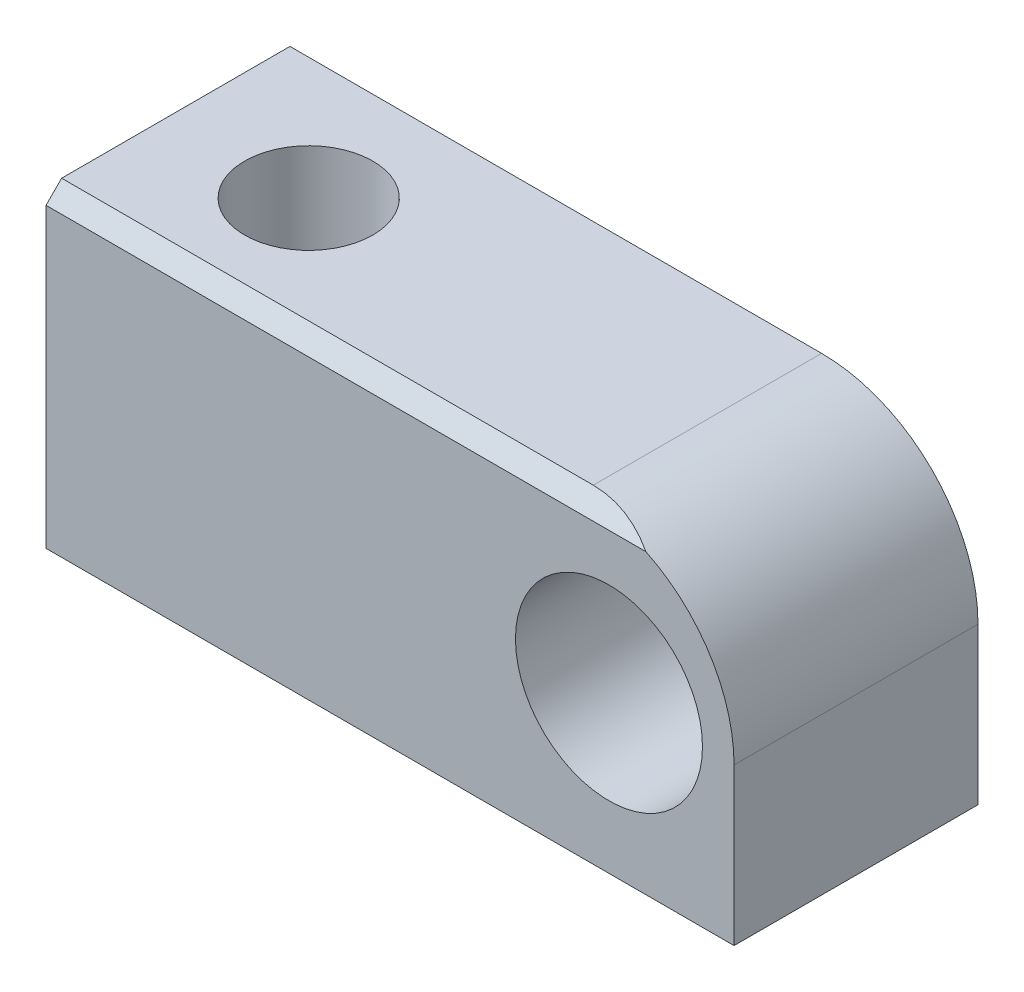
ISO-10303-21;
HEADER;
FILE_DESCRIPTION(('STEP AP214'),'2;1');
FILE_NAME('part.step','',(''),(''),'','','');
FILE_SCHEMA(('AUTOMOTIVE_DESIGN { 1 0 10303 214 1 1 1 1 }'));
ENDSEC;
DATA;
#1=APPLICATION_CONTEXT('core data for automotive mechanical design processes');
#2=APPLICATION_PROTOCOL_DEFINITION('international standard','automotive_design',2000,#1);
#3=PRODUCT_CONTEXT('',#1,'mechanical');
#4=PRODUCT('Part','Part','',(#3));
#5=PRODUCT_RELATED_PRODUCT_CATEGORY('part','',(#4));
#6=PRODUCT_DEFINITION_FORMATION('','',#4);
#7=PRODUCT_DEFINITION_CONTEXT('part definition',#1,'design');
#8=PRODUCT_DEFINITION('design','',#6,#7);
#9=PRODUCT_DEFINITION_SHAPE('','',#8);
#10=(LENGTH_UNIT() NAMED_UNIT(*) SI_UNIT(.MILLI.,.METRE.));
#11=(NAMED_UNIT(*) PLANE_ANGLE_UNIT() SI_UNIT($,.RADIAN.));
#12=(NAMED_UNIT(*) SI_UNIT($,.STERADIAN.) SOLID_ANGLE_UNIT());
#13=UNCERTAINTY_MEASURE_WITH_UNIT(LENGTH_MEASURE(1.E-05),#10,'distance_accuracy_value','');
#14=(GEOMETRIC_REPRESENTATION_CONTEXT(3) GLOBAL_UNCERTAINTY_ASSIGNED_CONTEXT((#13)) GLOBAL_UNIT_ASSIGNED_CONTEXT((#10,
#11,#12)) REPRESENTATION_CONTEXT('',''));
#15=CARTESIAN_POINT('',(0.,0.,0.));
#16=DIRECTION('',(0.,0.,1.));
#17=DIRECTION('',(1.,0.,0.));
#18=AXIS2_PLACEMENT_3D('',#15,#16,#17);
#19=CARTESIAN_POINT('',(-5.,4.99999999999999,3.9));
#20=DIRECTION('',(0.,0.,1.));
#21=DIRECTION('',(1.,0.,0.));
#22=AXIS2_PLACEMENT_3D('',#19,#20,#21);
#23=PLANE('',#22);
#24=DIRECTION('',(-1.,0.,0.));
#25=VECTOR('',#24,1.);
#26=CARTESIAN_POINT('',(0.,9.5,3.9));
#27=LINE('',#26,#25);
#28=CARTESIAN_POINT('',(-2.82055052822968,9.5,3.9));
#29=VERTEX_POINT('',#28);
#30=CARTESIAN_POINT('',(-22.,9.5,3.9));
#31=VERTEX_POINT('',#30);
#32=EDGE_CURVE('E86',#29,#31,#27,.T.);
#33=ORIENTED_EDGE('',*,*,#32,.T.);
#34=DIRECTION('',(0.,-1.,0.));
#35=VECTOR('',#34,1.);
#36=CARTESIAN_POINT('',(-22.,0.,3.9));
#37=LINE('',#36,#35);
#38=CARTESIAN_POINT('',(-22.,0.,3.9));
#39=VERTEX_POINT('',#38);
#40=EDGE_CURVE('E94',#31,#39,#37,.T.);
#41=ORIENTED_EDGE('',*,*,#40,.T.);
#42=DIRECTION('',(1.,0.,0.));
#43=VECTOR('',#42,1.);
#44=CARTESIAN_POINT('',(0.,0.,3.9));
#45=LINE('',#44,#43);
#46=CARTESIAN_POINT('',(0.,0.,3.9));
#47=VERTEX_POINT('',#46);
#48=EDGE_CURVE('E55',#39,#47,#45,.T.);
#49=ORIENTED_EDGE('',*,*,#48,.T.);
#50=DIRECTION('',(0.,1.,0.));
#51=VECTOR('',#50,1.);
#52=CARTESIAN_POINT('',(0.,4.99999999999999,3.9));
#53=LINE('',#52,#51);
#54=CARTESIAN_POINT('',(0.,4.99999999999999,3.9));
#55=VERTEX_POINT('',#54);
#56=EDGE_CURVE('E105',#47,#55,#53,.T.);
#57=ORIENTED_EDGE('',*,*,#56,.T.);
#58=CARTESIAN_POINT('',(-5.,4.99999999999999,3.9));
#59=DIRECTION('',(0.,0.,1.));
#60=DIRECTION('',(1.,0.,0.));
#61=AXIS2_PLACEMENT_3D('',#58,#59,#60);
#62=CIRCLE('',#61,5.);
#63=EDGE_CURVE('E96',#55,#29,#62,.T.);
#64=ORIENTED_EDGE('',*,*,#63,.T.);
#65=EDGE_LOOP('',(#33,#41,#49,#57,#64));
#66=FACE_BOUND('',#65,.T.);
#67=CARTESIAN_POINT('',(-4.,5.,3.9));
#68=DIRECTION('',(0.,0.,1.));
#69=DIRECTION('',(1.,0.,0.));
#70=AXIS2_PLACEMENT_3D('',#67,#68,#69);
#71=CIRCLE('',#70,2.99);
#72=CARTESIAN_POINT('',(-1.01,5.,3.9));
#73=VERTEX_POINT('',#72);
#74=EDGE_CURVE('E141',#73,#73,#71,.T.);
#75=ORIENTED_EDGE('',*,*,#74,.F.);
#76=EDGE_LOOP('',(#75));
#77=FACE_BOUND('',#76,.T.);
#78=ADVANCED_FACE('F32',(#66,#77),#23,.T.);
#79=CARTESIAN_POINT('',(-5.,4.99999999999999,-3.9));
#80=DIRECTION('',(0.,0.,1.));
#81=DIRECTION('',(1.,0.,0.));
#82=AXIS2_PLACEMENT_3D('',#79,#80,#81);
#83=PLANE('',#82);
#84=DIRECTION('',(0.,1.,0.));
#85=VECTOR('',#84,1.);
#86=CARTESIAN_POINT('',(0.,4.99999999999999,-3.9));
#87=LINE('',#86,#85);
#88=CARTESIAN_POINT('',(0.,0.,-3.9));
#89=VERTEX_POINT('',#88);
#90=CARTESIAN_POINT('',(0.,4.99999999999999,-3.9));
#91=VERTEX_POINT('',#90);
#92=EDGE_CURVE('E128',#89,#91,#87,.T.);
#93=ORIENTED_EDGE('',*,*,#92,.F.);
#94=DIRECTION('',(1.,0.,0.));
#95=VECTOR('',#94,1.);
#96=CARTESIAN_POINT('',(0.,0.,-3.9));
#97=LINE('',#96,#95);
#98=CARTESIAN_POINT('',(-22.,0.,-3.9));
#99=VERTEX_POINT('',#98);
#100=EDGE_CURVE('E135',#99,#89,#97,.T.);
#101=ORIENTED_EDGE('',*,*,#100,.F.);
#102=DIRECTION('',(0.,-1.,0.));
#103=VECTOR('',#102,1.);
#104=CARTESIAN_POINT('',(-22.,0.,-3.9));
#105=LINE('',#104,#103);
#106=CARTESIAN_POINT('',(-22.,10.,-3.9));
#107=VERTEX_POINT('',#106);
#108=EDGE_CURVE('E133',#107,#99,#105,.T.);
#109=ORIENTED_EDGE('',*,*,#108,.F.);
#110=DIRECTION('',(-1.,0.,0.));
#111=VECTOR('',#110,1.);
#112=CARTESIAN_POINT('',(-22.,10.,-3.9));
#113=LINE('',#112,#111);
#114=CARTESIAN_POINT('',(-5.,9.99999999999999,-3.9));
#115=VERTEX_POINT('',#114);
#116=EDGE_CURVE('E119',#115,#107,#113,.T.);
#117=ORIENTED_EDGE('',*,*,#116,.F.);
#118=CARTESIAN_POINT('',(-5.,4.99999999999999,-3.9));
#119=DIRECTION('',(0.,0.,1.));
#120=DIRECTION('',(1.,0.,0.));
#121=AXIS2_PLACEMENT_3D('',#118,#119,#120);
#122=CIRCLE('',#121,5.);
#123=EDGE_CURVE('E122',#91,#115,#122,.T.);
#124=ORIENTED_EDGE('',*,*,#123,.F.);
#125=EDGE_LOOP('',(#93,#101,#109,#117,#124));
#126=FACE_BOUND('',#125,.T.);
#127=CARTESIAN_POINT('',(-4.,5.,-3.9));
#128=DIRECTION('',(0.,0.,1.));
#129=DIRECTION('',(1.,0.,0.));
#130=AXIS2_PLACEMENT_3D('',#127,#128,#129);
#131=CIRCLE('',#130,2.99);
#132=CARTESIAN_POINT('',(-1.01,5.,-3.9));
#133=VERTEX_POINT('',#132);
#134=EDGE_CURVE('E143',#133,#133,#131,.T.);
#135=ORIENTED_EDGE('',*,*,#134,.T.);
#136=EDGE_LOOP('',(#135));
#137=FACE_BOUND('',#136,.T.);
#138=ADVANCED_FACE('F130',(#126,#137),#83,.F.);
#139=CARTESIAN_POINT('',(0.,4.99999999999999,3.9));
#140=DIRECTION('',(-1.,0.,0.));
#141=DIRECTION('',(0.,-1.,0.));
#142=AXIS2_PLACEMENT_3D('',#139,#140,#141);
#143=PLANE('',#142);
#144=ORIENTED_EDGE('',*,*,#92,.T.);
#145=DIRECTION('',(0.,0.,-1.));
#146=VECTOR('',#145,1.);
#147=CARTESIAN_POINT('',(0.,4.99999999999999,3.9));
#148=LINE('',#147,#146);
#149=EDGE_CURVE('E11',#55,#91,#148,.T.);
#150=ORIENTED_EDGE('',*,*,#149,.F.);
#151=ORIENTED_EDGE('',*,*,#56,.F.);
#152=DIRECTION('',(0.,0.,-1.));
#153=VECTOR('',#152,1.);
#154=CARTESIAN_POINT('',(0.,0.,3.9));
#155=LINE('',#154,#153);
#156=EDGE_CURVE('E103',#47,#89,#155,.T.);
#157=ORIENTED_EDGE('',*,*,#156,.T.);
#158=EDGE_LOOP('',(#144,#150,#151,#157));
#159=FACE_BOUND('',#158,.T.);
#160=ADVANCED_FACE('F34',(#159),#143,.F.);
#161=CARTESIAN_POINT('',(-5.,4.99999999999999,3.9));
#162=DIRECTION('',(0.,0.,-1.));
#163=DIRECTION('',(-1.,0.,0.));
#164=AXIS2_PLACEMENT_3D('',#161,#162,#163);
#165=CYLINDRICAL_SURFACE('',#164,5.);
#166=DIRECTION('',(0.,0.,-1.));
#167=VECTOR('',#166,1.);
#168=CARTESIAN_POINT('',(-5.,9.99999999999999,3.9));
#169=LINE('',#168,#167);
#170=CARTESIAN_POINT('',(-5.,10.,3.4));
#171=VERTEX_POINT('',#170);
#172=EDGE_CURVE('E40',#171,#115,#169,.T.);
#173=ORIENTED_EDGE('',*,*,#172,.F.);
#174=CARTESIAN_POINT('',(-5.,4.99999999999999,8.40000000000005));
#175=DIRECTION('',(0.,-0.707106781186551,-0.707106781186544));
#176=DIRECTION('',(0.,0.707106781186544,-0.707106781186551));
#177=AXIS2_PLACEMENT_3D('',#174,#175,#176);
#178=ELLIPSE('',#177,7.07106781186551,5.);
#179=EDGE_CURVE('E97',#171,#29,#178,.T.);
#180=ORIENTED_EDGE('',*,*,#179,.T.);
#181=ORIENTED_EDGE('',*,*,#63,.F.);
#182=ORIENTED_EDGE('',*,*,#149,.T.);
#183=ORIENTED_EDGE('',*,*,#123,.T.);
#184=EDGE_LOOP('',(#173,#180,#181,#182,#183));
#185=FACE_BOUND('',#184,.T.);
#186=ADVANCED_FACE('F123',(#185),#165,.T.);
#187=CARTESIAN_POINT('',(-22.,10.,3.9));
#188=DIRECTION('',(0.,-1.,0.));
#189=DIRECTION('',(1.,0.,0.));
#190=AXIS2_PLACEMENT_3D('',#187,#188,#189);
#191=PLANE('',#190);
#192=CARTESIAN_POINT('',(-17.5,10.,0.));
#193=DIRECTION('',(0.,-1.,0.));
#194=DIRECTION('',(1.,0.,0.));
#195=AXIS2_PLACEMENT_3D('',#192,#193,#194);
#196=CIRCLE('',#195,2.05);
#197=CARTESIAN_POINT('',(-15.45,10.,0.));
#198=VERTEX_POINT('',#197);
#199=EDGE_CURVE('E148',#198,#198,#196,.T.);
#200=ORIENTED_EDGE('',*,*,#199,.T.);
#201=EDGE_LOOP('',(#200));
#202=FACE_BOUND('',#201,.T.);
#203=DIRECTION('',(0.,0.,-1.));
#204=VECTOR('',#203,1.);
#205=CARTESIAN_POINT('',(-22.,10.,3.9));
#206=LINE('',#205,#204);
#207=CARTESIAN_POINT('',(-22.,10.,3.4));
#208=VERTEX_POINT('',#207);
#209=EDGE_CURVE('E112',#208,#107,#206,.T.);
#210=ORIENTED_EDGE('',*,*,#209,.F.);
#211=DIRECTION('',(-1.,0.,0.));
#212=VECTOR('',#211,1.);
#213=CARTESIAN_POINT('',(0.,10.,3.4));
#214=LINE('',#213,#212);
#215=EDGE_CURVE('E47',#171,#208,#214,.T.);
#216=ORIENTED_EDGE('',*,*,#215,.F.);
#217=ORIENTED_EDGE('',*,*,#172,.T.);
#218=ORIENTED_EDGE('',*,*,#116,.T.);
#219=EDGE_LOOP('',(#210,#216,#217,#218));
#220=FACE_BOUND('',#219,.T.);
#221=ADVANCED_FACE('F117',(#202,#220),#191,.F.);
#222=CARTESIAN_POINT('',(-22.,0.,3.9));
#223=DIRECTION('',(1.,0.,0.));
#224=DIRECTION('',(0.,0.,-1.));
#225=AXIS2_PLACEMENT_3D('',#222,#223,#224);
#226=PLANE('',#225);
#227=ORIENTED_EDGE('',*,*,#40,.F.);
#228=DIRECTION('',(0.,-0.707106781186544,0.707106781186551));
#229=VECTOR('',#228,1.);
#230=CARTESIAN_POINT('',(-22.,9.5,3.9));
#231=LINE('',#230,#229);
#232=EDGE_CURVE('E83',#208,#31,#231,.T.);
#233=ORIENTED_EDGE('',*,*,#232,.F.);
#234=ORIENTED_EDGE('',*,*,#209,.T.);
#235=ORIENTED_EDGE('',*,*,#108,.T.);
#236=DIRECTION('',(0.,0.,-1.));
#237=VECTOR('',#236,1.);
#238=CARTESIAN_POINT('',(-22.,0.,3.9));
#239=LINE('',#238,#237);
#240=EDGE_CURVE('E101',#39,#99,#239,.T.);
#241=ORIENTED_EDGE('',*,*,#240,.F.);
#242=EDGE_LOOP('',(#227,#233,#234,#235,#241));
#243=FACE_BOUND('',#242,.T.);
#244=ADVANCED_FACE('F99',(#243),#226,.F.);
#245=CARTESIAN_POINT('',(0.,0.,3.9));
#246=DIRECTION('',(0.,1.,0.));
#247=DIRECTION('',(-1.,0.,0.));
#248=AXIS2_PLACEMENT_3D('',#245,#246,#247);
#249=PLANE('',#248);
#250=CARTESIAN_POINT('',(-17.5,0.,0.));
#251=DIRECTION('',(0.,-1.,0.));
#252=DIRECTION('',(1.,0.,0.));
#253=AXIS2_PLACEMENT_3D('',#250,#251,#252);
#254=CIRCLE('',#253,2.05);
#255=CARTESIAN_POINT('',(-15.45,0.,0.));
#256=VERTEX_POINT('',#255);
#257=EDGE_CURVE('E151',#256,#256,#254,.T.);
#258=ORIENTED_EDGE('',*,*,#257,.F.);
#259=EDGE_LOOP('',(#258));
#260=FACE_BOUND('',#259,.T.);
#261=ORIENTED_EDGE('',*,*,#100,.T.);
#262=ORIENTED_EDGE('',*,*,#156,.F.);
#263=ORIENTED_EDGE('',*,*,#48,.F.);
#264=ORIENTED_EDGE('',*,*,#240,.T.);
#265=EDGE_LOOP('',(#261,#262,#263,#264));
#266=FACE_BOUND('',#265,.T.);
#267=ADVANCED_FACE('F159',(#260,#266),#249,.F.);
#268=CARTESIAN_POINT('',(-4.,5.,3.9));
#269=DIRECTION('',(0.,0.,-1.));
#270=DIRECTION('',(-1.,0.,0.));
#271=AXIS2_PLACEMENT_3D('',#268,#269,#270);
#272=CYLINDRICAL_SURFACE('',#271,2.99);
#273=ORIENTED_EDGE('',*,*,#74,.T.);
#274=EDGE_LOOP('',(#273));
#275=FACE_BOUND('',#274,.T.);
#276=ORIENTED_EDGE('',*,*,#134,.F.);
#277=EDGE_LOOP('',(#276));
#278=FACE_BOUND('',#277,.T.);
#279=ADVANCED_FACE('F162',(#275,#278),#272,.F.);
#280=CARTESIAN_POINT('',(-17.5,10.,0.));
#281=DIRECTION('',(0.,-1.,0.));
#282=DIRECTION('',(1.,0.,0.));
#283=AXIS2_PLACEMENT_3D('',#280,#281,#282);
#284=CYLINDRICAL_SURFACE('',#283,2.05);
#285=ORIENTED_EDGE('',*,*,#199,.F.);
#286=EDGE_LOOP('',(#285));
#287=FACE_BOUND('',#286,.T.);
#288=ORIENTED_EDGE('',*,*,#257,.T.);
#289=EDGE_LOOP('',(#288));
#290=FACE_BOUND('',#289,.T.);
#291=ADVANCED_FACE('F157',(#287,#290),#284,.F.);
#292=CARTESIAN_POINT('',(0.,9.5,3.9));
#293=DIRECTION('',(0.,-0.707106781186551,-0.707106781186544));
#294=DIRECTION('',(0.,0.707106781186544,-0.707106781186551));
#295=AXIS2_PLACEMENT_3D('',#292,#293,#294);
#296=PLANE('',#295);
#297=ORIENTED_EDGE('',*,*,#215,.T.);
#298=ORIENTED_EDGE('',*,*,#232,.T.);
#299=ORIENTED_EDGE('',*,*,#32,.F.);
#300=ORIENTED_EDGE('',*,*,#179,.F.);
#301=EDGE_LOOP('',(#297,#298,#299,#300));
#302=FACE_BOUND('',#301,.T.);
#303=ADVANCED_FACE('F85',(#302),#296,.F.);
#304=CLOSED_SHELL('',(#78,#138,#160,#186,#221,#244,#267,#279,#291,#303));
#305=MANIFOLD_SOLID_BREP('B2',#304);
#306=ADVANCED_BREP_SHAPE_REPRESENTATION('',(#18,#305),#14);
#307=SHAPE_DEFINITION_REPRESENTATION(#9,#306);
ENDSEC;
END-ISO-10303-21;
